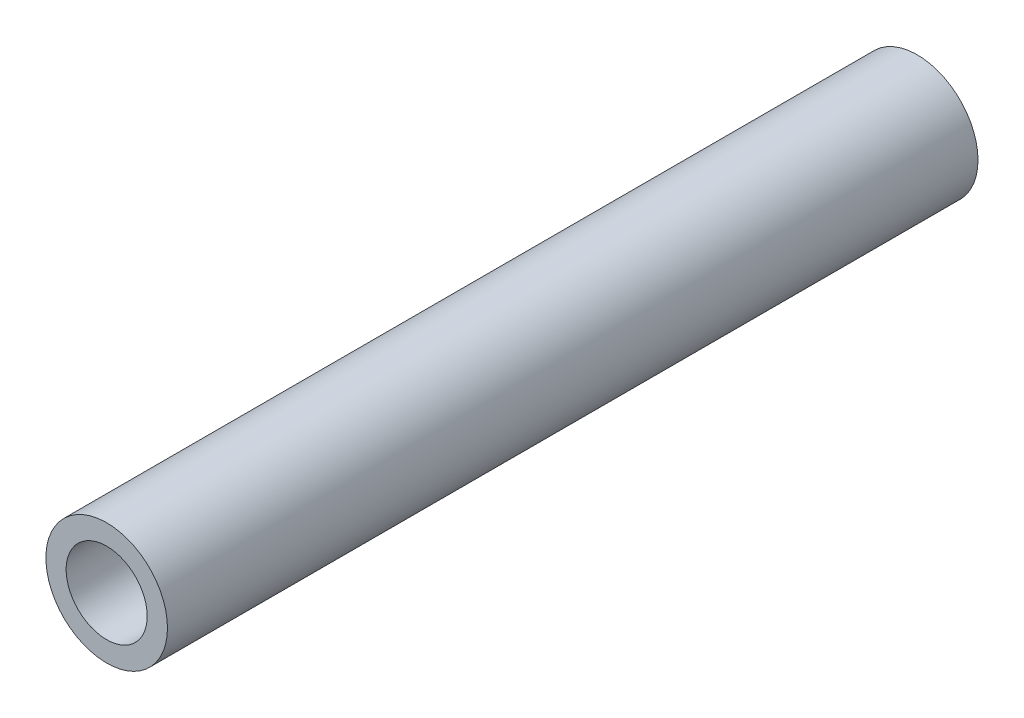
ISO-10303-21;
HEADER;
FILE_DESCRIPTION(('STEP AP214'),'2;1');
FILE_NAME('part.step','',(''),(''),'','','');
FILE_SCHEMA(('AUTOMOTIVE_DESIGN { 1 0 10303 214 1 1 1 1 }'));
ENDSEC;
DATA;
#1=APPLICATION_CONTEXT('core data for automotive mechanical design processes');
#2=APPLICATION_PROTOCOL_DEFINITION('international standard','automotive_design',2000,#1);
#3=PRODUCT_CONTEXT('',#1,'mechanical');
#4=PRODUCT('Part','Part','',(#3));
#5=PRODUCT_RELATED_PRODUCT_CATEGORY('part','',(#4));
#6=PRODUCT_DEFINITION_FORMATION('','',#4);
#7=PRODUCT_DEFINITION_CONTEXT('part definition',#1,'design');
#8=PRODUCT_DEFINITION('design','',#6,#7);
#9=PRODUCT_DEFINITION_SHAPE('','',#8);
#10=(LENGTH_UNIT() NAMED_UNIT(*) SI_UNIT(.MILLI.,.METRE.));
#11=(NAMED_UNIT(*) PLANE_ANGLE_UNIT() SI_UNIT($,.RADIAN.));
#12=(NAMED_UNIT(*) SI_UNIT($,.STERADIAN.) SOLID_ANGLE_UNIT());
#13=UNCERTAINTY_MEASURE_WITH_UNIT(LENGTH_MEASURE(1.E-05),#10,'distance_accuracy_value','');
#14=(GEOMETRIC_REPRESENTATION_CONTEXT(3) GLOBAL_UNCERTAINTY_ASSIGNED_CONTEXT((#13)) GLOBAL_UNIT_ASSIGNED_CONTEXT((#10,
#11,#12)) REPRESENTATION_CONTEXT('',''));
#15=CARTESIAN_POINT('',(0.,0.,0.));
#16=DIRECTION('',(0.,0.,1.));
#17=DIRECTION('',(1.,0.,0.));
#18=AXIS2_PLACEMENT_3D('',#15,#16,#17);
#19=CARTESIAN_POINT('',(0.,0.,101.6));
#20=DIRECTION('',(0.,0.,1.));
#21=DIRECTION('',(1.,0.,0.));
#22=AXIS2_PLACEMENT_3D('',#19,#20,#21);
#23=PLANE('',#22);
#24=CARTESIAN_POINT('',(0.,0.,101.6));
#25=DIRECTION('',(0.,0.,1.));
#26=DIRECTION('',(1.,0.,0.));
#27=AXIS2_PLACEMENT_3D('',#24,#25,#26);
#28=CIRCLE('',#27,7.62);
#29=CARTESIAN_POINT('',(7.62,0.,101.6));
#30=VERTEX_POINT('',#29);
#31=EDGE_CURVE('E10',#30,#30,#28,.T.);
#32=ORIENTED_EDGE('',*,*,#31,.T.);
#33=EDGE_LOOP('',(#32));
#34=FACE_BOUND('',#33,.T.);
#35=CARTESIAN_POINT('',(0.,0.,101.6));
#36=DIRECTION('',(0.,0.,1.));
#37=DIRECTION('',(1.,0.,0.));
#38=AXIS2_PLACEMENT_3D('',#35,#36,#37);
#39=CIRCLE('',#38,5.08);
#40=CARTESIAN_POINT('',(5.08,0.,101.6));
#41=VERTEX_POINT('',#40);
#42=EDGE_CURVE('E41',#41,#41,#39,.T.);
#43=ORIENTED_EDGE('',*,*,#42,.F.);
#44=EDGE_LOOP('',(#43));
#45=FACE_BOUND('',#44,.T.);
#46=ADVANCED_FACE('F30',(#34,#45),#23,.T.);
#47=CARTESIAN_POINT('',(0.,0.,0.));
#48=DIRECTION('',(0.,0.,1.));
#49=DIRECTION('',(1.,0.,0.));
#50=AXIS2_PLACEMENT_3D('',#47,#48,#49);
#51=PLANE('',#50);
#52=CARTESIAN_POINT('',(0.,0.,0.));
#53=DIRECTION('',(0.,0.,1.));
#54=DIRECTION('',(1.,0.,0.));
#55=AXIS2_PLACEMENT_3D('',#52,#53,#54);
#56=CIRCLE('',#55,7.62);
#57=CARTESIAN_POINT('',(7.62,0.,0.));
#58=VERTEX_POINT('',#57);
#59=EDGE_CURVE('E34',#58,#58,#56,.T.);
#60=ORIENTED_EDGE('',*,*,#59,.F.);
#61=EDGE_LOOP('',(#60));
#62=FACE_BOUND('',#61,.T.);
#63=CARTESIAN_POINT('',(0.,0.,0.));
#64=DIRECTION('',(0.,0.,1.));
#65=DIRECTION('',(1.,0.,0.));
#66=AXIS2_PLACEMENT_3D('',#63,#64,#65);
#67=CIRCLE('',#66,5.08);
#68=CARTESIAN_POINT('',(5.08,0.,0.));
#69=VERTEX_POINT('',#68);
#70=EDGE_CURVE('E43',#69,#69,#67,.T.);
#71=ORIENTED_EDGE('',*,*,#70,.T.);
#72=EDGE_LOOP('',(#71));
#73=FACE_BOUND('',#72,.T.);
#74=ADVANCED_FACE('F53',(#62,#73),#51,.F.);
#75=CARTESIAN_POINT('',(0.,0.,101.6));
#76=DIRECTION('',(0.,0.,-1.));
#77=DIRECTION('',(-1.,0.,0.));
#78=AXIS2_PLACEMENT_3D('',#75,#76,#77);
#79=CYLINDRICAL_SURFACE('',#78,7.62);
#80=ORIENTED_EDGE('',*,*,#31,.F.);
#81=EDGE_LOOP('',(#80));
#82=FACE_BOUND('',#81,.T.);
#83=ORIENTED_EDGE('',*,*,#59,.T.);
#84=EDGE_LOOP('',(#83));
#85=FACE_BOUND('',#84,.T.);
#86=ADVANCED_FACE('F32',(#82,#85),#79,.T.);
#87=CARTESIAN_POINT('',(0.,0.,101.6));
#88=DIRECTION('',(0.,0.,-1.));
#89=DIRECTION('',(-1.,0.,0.));
#90=AXIS2_PLACEMENT_3D('',#87,#88,#89);
#91=CYLINDRICAL_SURFACE('',#90,5.08);
#92=ORIENTED_EDGE('',*,*,#42,.T.);
#93=EDGE_LOOP('',(#92));
#94=FACE_BOUND('',#93,.T.);
#95=ORIENTED_EDGE('',*,*,#70,.F.);
#96=EDGE_LOOP('',(#95));
#97=FACE_BOUND('',#96,.T.);
#98=ADVANCED_FACE('F49',(#94,#97),#91,.F.);
#99=CLOSED_SHELL('',(#46,#74,#86,#98));
#100=MANIFOLD_SOLID_BREP('B2',#99);
#101=ADVANCED_BREP_SHAPE_REPRESENTATION('',(#18,#100),#14);
#102=SHAPE_DEFINITION_REPRESENTATION(#9,#101);
ENDSEC;
END-ISO-10303-21;
